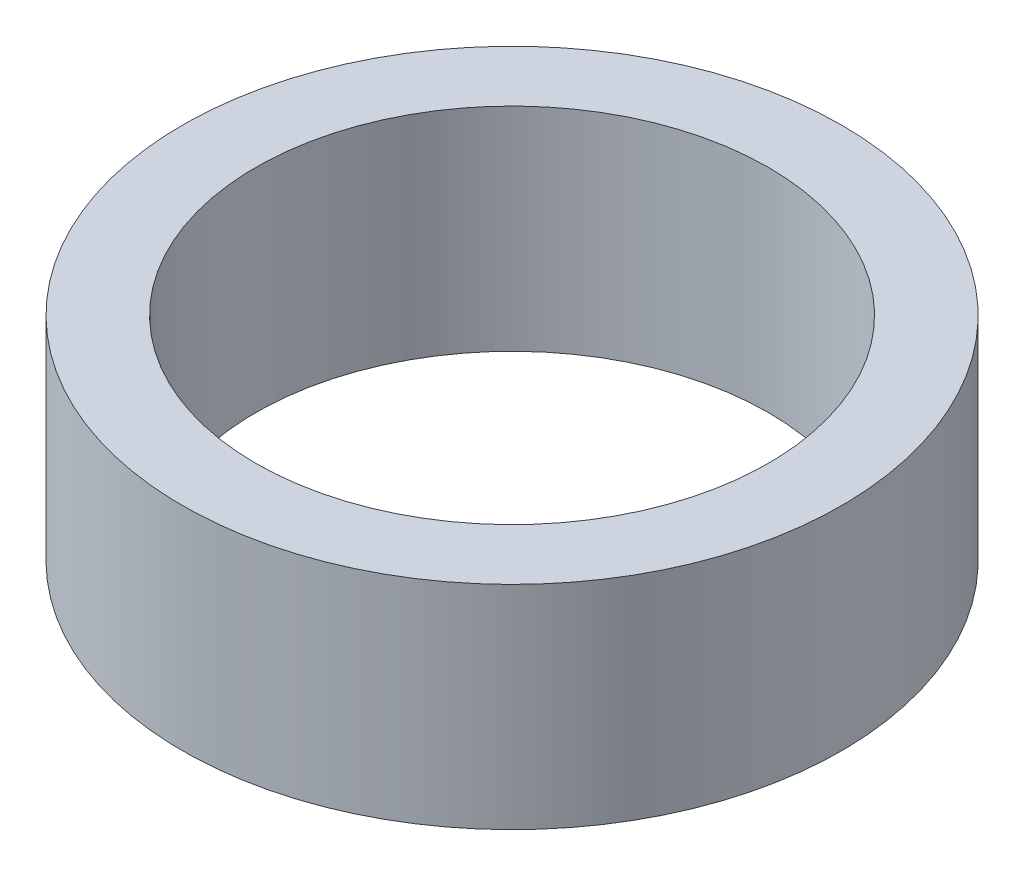
ISO-10303-21;
HEADER;
FILE_DESCRIPTION(('STEP AP214'),'2;1');
FILE_NAME('part.step','',(''),(''),'','','');
FILE_SCHEMA(('AUTOMOTIVE_DESIGN { 1 0 10303 214 1 1 1 1 }'));
ENDSEC;
DATA;
#1=APPLICATION_CONTEXT('core data for automotive mechanical design processes');
#2=APPLICATION_PROTOCOL_DEFINITION('international standard','automotive_design',2000,#1);
#3=PRODUCT_CONTEXT('',#1,'mechanical');
#4=PRODUCT('Part','Part','',(#3));
#5=PRODUCT_RELATED_PRODUCT_CATEGORY('part','',(#4));
#6=PRODUCT_DEFINITION_FORMATION('','',#4);
#7=PRODUCT_DEFINITION_CONTEXT('part definition',#1,'design');
#8=PRODUCT_DEFINITION('design','',#6,#7);
#9=PRODUCT_DEFINITION_SHAPE('','',#8);
#10=(LENGTH_UNIT() NAMED_UNIT(*) SI_UNIT(.MILLI.,.METRE.));
#11=(NAMED_UNIT(*) PLANE_ANGLE_UNIT() SI_UNIT($,.RADIAN.));
#12=(NAMED_UNIT(*) SI_UNIT($,.STERADIAN.) SOLID_ANGLE_UNIT());
#13=UNCERTAINTY_MEASURE_WITH_UNIT(LENGTH_MEASURE(1.E-05),#10,'distance_accuracy_value','');
#14=(GEOMETRIC_REPRESENTATION_CONTEXT(3) GLOBAL_UNCERTAINTY_ASSIGNED_CONTEXT((#13)) GLOBAL_UNIT_ASSIGNED_CONTEXT((#10,
#11,#12)) REPRESENTATION_CONTEXT('',''));
#15=CARTESIAN_POINT('',(0.,0.,0.));
#16=DIRECTION('',(0.,0.,1.));
#17=DIRECTION('',(1.,0.,0.));
#18=AXIS2_PLACEMENT_3D('',#15,#16,#17);
#19=CARTESIAN_POINT('',(0.,29.,0.));
#20=DIRECTION('',(0.,-1.,0.));
#21=DIRECTION('',(0.,0.,-1.));
#22=AXIS2_PLACEMENT_3D('',#19,#20,#21);
#23=CYLINDRICAL_SURFACE('',#22,45.);
#24=CARTESIAN_POINT('',(0.,29.,0.));
#25=DIRECTION('',(0.,1.,0.));
#26=DIRECTION('',(0.,0.,1.));
#27=AXIS2_PLACEMENT_3D('',#24,#25,#26);
#28=CIRCLE('',#27,45.);
#29=CARTESIAN_POINT('',(0.,29.,-45.));
#30=VERTEX_POINT('',#29);
#31=EDGE_CURVE('E10',#30,#30,#28,.T.);
#32=CARTESIAN_POINT('',(0.,0.,0.));
#33=DIRECTION('',(0.,1.,0.));
#34=DIRECTION('',(0.,0.,1.));
#35=AXIS2_PLACEMENT_3D('',#32,#33,#34);
#36=CIRCLE('',#35,45.);
#37=CARTESIAN_POINT('',(0.,0.,-45.));
#38=VERTEX_POINT('',#37);
#39=EDGE_CURVE('E37',#38,#38,#36,.T.);
#40=CARTESIAN_POINT('',(0.,29.,-45.));
#41=CARTESIAN_POINT('',(0.,28.6979166666667,-45.));
#42=CARTESIAN_POINT('',(0.,28.3958333333333,-45.));
#43=CARTESIAN_POINT('',(0.,27.7916666666667,-45.));
#44=CARTESIAN_POINT('',(0.,27.4895833333333,-45.));
#45=CARTESIAN_POINT('',(0.,26.8854166666667,-45.));
#46=CARTESIAN_POINT('',(0.,26.5833333333333,-45.));
#47=CARTESIAN_POINT('',(0.,25.9791666666667,-45.));
#48=CARTESIAN_POINT('',(0.,25.6770833333333,-45.));
#49=CARTESIAN_POINT('',(0.,25.0729166666667,-45.));
#50=CARTESIAN_POINT('',(0.,24.7708333333333,-45.));
#51=CARTESIAN_POINT('',(0.,24.1666666666667,-45.));
#52=CARTESIAN_POINT('',(0.,23.8645833333333,-45.));
#53=CARTESIAN_POINT('',(0.,23.2604166666667,-45.));
#54=CARTESIAN_POINT('',(0.,22.9583333333333,-45.));
#55=CARTESIAN_POINT('',(0.,22.3541666666667,-45.));
#56=CARTESIAN_POINT('',(0.,22.0520833333333,-45.));
#57=CARTESIAN_POINT('',(0.,21.4479166666667,-45.));
#58=CARTESIAN_POINT('',(0.,21.1458333333333,-45.));
#59=CARTESIAN_POINT('',(0.,20.5416666666667,-45.));
#60=CARTESIAN_POINT('',(0.,20.2395833333333,-45.));
#61=CARTESIAN_POINT('',(0.,19.6354166666667,-45.));
#62=CARTESIAN_POINT('',(0.,19.3333333333333,-45.));
#63=CARTESIAN_POINT('',(0.,18.7291666666667,-45.));
#64=CARTESIAN_POINT('',(0.,18.4270833333333,-45.));
#65=CARTESIAN_POINT('',(0.,17.8229166666667,-45.));
#66=CARTESIAN_POINT('',(0.,17.5208333333333,-45.));
#67=CARTESIAN_POINT('',(0.,16.9166666666667,-45.));
#68=CARTESIAN_POINT('',(0.,16.6145833333333,-45.));
#69=CARTESIAN_POINT('',(0.,16.0104166666667,-45.));
#70=CARTESIAN_POINT('',(0.,15.7083333333333,-45.));
#71=CARTESIAN_POINT('',(0.,15.1041666666667,-45.));
#72=CARTESIAN_POINT('',(0.,14.8020833333333,-45.));
#73=CARTESIAN_POINT('',(0.,14.1979166666667,-45.));
#74=CARTESIAN_POINT('',(0.,13.8958333333333,-45.));
#75=CARTESIAN_POINT('',(0.,13.2916666666667,-45.));
#76=CARTESIAN_POINT('',(0.,12.9895833333333,-45.));
#77=CARTESIAN_POINT('',(0.,12.3854166666667,-45.));
#78=CARTESIAN_POINT('',(0.,12.0833333333333,-45.));
#79=CARTESIAN_POINT('',(0.,11.4791666666667,-45.));
#80=CARTESIAN_POINT('',(0.,11.1770833333333,-45.));
#81=CARTESIAN_POINT('',(0.,10.5729166666667,-45.));
#82=CARTESIAN_POINT('',(0.,10.2708333333333,-45.));
#83=CARTESIAN_POINT('',(0.,9.66666666666667,-45.));
#84=CARTESIAN_POINT('',(0.,9.36458333333333,-45.));
#85=CARTESIAN_POINT('',(0.,8.76041666666667,-45.));
#86=CARTESIAN_POINT('',(0.,8.45833333333333,-45.));
#87=CARTESIAN_POINT('',(0.,7.85416666666667,-45.));
#88=CARTESIAN_POINT('',(0.,7.55208333333333,-45.));
#89=CARTESIAN_POINT('',(0.,6.94791666666667,-45.));
#90=CARTESIAN_POINT('',(0.,6.64583333333333,-45.));
#91=CARTESIAN_POINT('',(0.,6.04166666666667,-45.));
#92=CARTESIAN_POINT('',(0.,5.73958333333333,-45.));
#93=CARTESIAN_POINT('',(0.,5.13541666666667,-45.));
#94=CARTESIAN_POINT('',(0.,4.83333333333333,-45.));
#95=CARTESIAN_POINT('',(0.,4.22916666666667,-45.));
#96=CARTESIAN_POINT('',(0.,3.92708333333333,-45.));
#97=CARTESIAN_POINT('',(0.,3.32291666666667,-45.));
#98=CARTESIAN_POINT('',(0.,3.02083333333333,-45.));
#99=CARTESIAN_POINT('',(0.,2.41666666666667,-45.));
#100=CARTESIAN_POINT('',(0.,2.11458333333333,-45.));
#101=CARTESIAN_POINT('',(0.,1.51041666666667,-45.));
#102=CARTESIAN_POINT('',(0.,1.20833333333333,-45.));
#103=CARTESIAN_POINT('',(0.,0.604166666666667,-45.));
#104=CARTESIAN_POINT('',(0.,0.302083333333333,-45.));
#105=CARTESIAN_POINT('',(0.,0.,-45.));
#106=B_SPLINE_CURVE_WITH_KNOTS('',3,(#40,#41,#42,#43,#44,#45,#46,#47,#48,#49,#50,#51,#52,#53,
#54,#55,#56,#57,#58,#59,#60,#61,#62,#63,#64,#65,#66,#67,#68,#69,#70,#71,#72,#73,#74,#75,#76,#77,
#78,#79,#80,#81,#82,#83,#84,#85,#86,#87,#88,#89,#90,#91,#92,#93,#94,#95,#96,#97,#98,#99,#100,
#101,#102,#103,#104,#105),.UNSPECIFIED.,.F.,.F.,(4,2,2,2,2,2,2,2,2,2,2,2,2,2,2,2,2,2,2,2,2,2,2,
2,2,2,2,2,2,2,2,2,4),(0.,0.906249999999997,1.8125,2.71875,3.625,4.53125,5.4375,6.34375,7.25,
8.15625,9.0625,9.96875,10.875,11.78125,12.6875,13.59375,14.5,15.40625,16.3125,17.21875,18.125,
19.03125,19.9375,20.84375,21.75,22.65625,23.5625,24.46875,25.375,26.28125,27.1875,28.09375,29.),.UNSPECIFIED.);
#107=EDGE_CURVE('BSEAM40',#30,#38,#106,.T.);
#108=ORIENTED_EDGE('',*,*,#31,.F.);
#109=ORIENTED_EDGE('',*,*,#39,.T.);
#110=ORIENTED_EDGE('',*,*,#107,.T.);
#111=ORIENTED_EDGE('',*,*,#107,.F.);
#112=EDGE_LOOP('',(#108,#110,#109,#111));
#113=FACE_BOUND('',#112,.T.);
#114=ADVANCED_FACE('F40',(#113),#23,.T.);
#115=CARTESIAN_POINT('',(0.,29.,0.));
#116=DIRECTION('',(0.,1.,0.));
#117=DIRECTION('',(0.,0.,1.));
#118=AXIS2_PLACEMENT_3D('',#115,#116,#117);
#119=PLANE('',#118);
#120=CARTESIAN_POINT('',(0.,29.,0.));
#121=DIRECTION('',(0.,1.,0.));
#122=DIRECTION('',(0.,0.,1.));
#123=AXIS2_PLACEMENT_3D('',#120,#121,#122);
#124=CIRCLE('',#123,35.);
#125=CARTESIAN_POINT('',(0.,29.,-35.));
#126=VERTEX_POINT('',#125);
#127=EDGE_CURVE('E50',#126,#126,#124,.T.);
#128=ORIENTED_EDGE('',*,*,#127,.F.);
#129=EDGE_LOOP('',(#128));
#130=FACE_BOUND('',#129,.T.);
#131=ORIENTED_EDGE('',*,*,#31,.T.);
#132=EDGE_LOOP('',(#131));
#133=FACE_BOUND('',#132,.T.);
#134=ADVANCED_FACE('F59',(#130,#133),#119,.T.);
#135=CARTESIAN_POINT('',(0.,0.,0.));
#136=DIRECTION('',(0.,1.,0.));
#137=DIRECTION('',(0.,0.,1.));
#138=AXIS2_PLACEMENT_3D('',#135,#136,#137);
#139=PLANE('',#138);
#140=CARTESIAN_POINT('',(0.,0.,0.));
#141=DIRECTION('',(0.,1.,0.));
#142=DIRECTION('',(0.,0.,1.));
#143=AXIS2_PLACEMENT_3D('',#140,#141,#142);
#144=CIRCLE('',#143,35.);
#145=CARTESIAN_POINT('',(0.,0.,-35.));
#146=VERTEX_POINT('',#145);
#147=EDGE_CURVE('E47',#146,#146,#144,.T.);
#148=ORIENTED_EDGE('',*,*,#147,.T.);
#149=EDGE_LOOP('',(#148));
#150=FACE_BOUND('',#149,.T.);
#151=ORIENTED_EDGE('',*,*,#39,.F.);
#152=EDGE_LOOP('',(#151));
#153=FACE_BOUND('',#152,.T.);
#154=ADVANCED_FACE('F58',(#150,#153),#139,.F.);
#155=CARTESIAN_POINT('',(0.,29.,0.));
#156=DIRECTION('',(0.,-1.,0.));
#157=DIRECTION('',(0.,0.,-1.));
#158=AXIS2_PLACEMENT_3D('',#155,#156,#157);
#159=CYLINDRICAL_SURFACE('',#158,35.);
#160=CARTESIAN_POINT('',(0.,29.,-35.));
#161=CARTESIAN_POINT('',(0.,28.6979166666667,-35.));
#162=CARTESIAN_POINT('',(0.,28.3958333333333,-35.));
#163=CARTESIAN_POINT('',(0.,27.7916666666667,-35.));
#164=CARTESIAN_POINT('',(0.,27.4895833333333,-35.));
#165=CARTESIAN_POINT('',(0.,26.8854166666667,-35.));
#166=CARTESIAN_POINT('',(0.,26.5833333333333,-35.));
#167=CARTESIAN_POINT('',(0.,25.9791666666667,-35.));
#168=CARTESIAN_POINT('',(0.,25.6770833333333,-35.));
#169=CARTESIAN_POINT('',(0.,25.0729166666667,-35.));
#170=CARTESIAN_POINT('',(0.,24.7708333333333,-35.));
#171=CARTESIAN_POINT('',(0.,24.1666666666667,-35.));
#172=CARTESIAN_POINT('',(0.,23.8645833333333,-35.));
#173=CARTESIAN_POINT('',(0.,23.2604166666667,-35.));
#174=CARTESIAN_POINT('',(0.,22.9583333333333,-35.));
#175=CARTESIAN_POINT('',(0.,22.3541666666667,-35.));
#176=CARTESIAN_POINT('',(0.,22.0520833333333,-35.));
#177=CARTESIAN_POINT('',(0.,21.4479166666667,-35.));
#178=CARTESIAN_POINT('',(0.,21.1458333333333,-35.));
#179=CARTESIAN_POINT('',(0.,20.5416666666667,-35.));
#180=CARTESIAN_POINT('',(0.,20.2395833333333,-35.));
#181=CARTESIAN_POINT('',(0.,19.6354166666667,-35.));
#182=CARTESIAN_POINT('',(0.,19.3333333333333,-35.));
#183=CARTESIAN_POINT('',(0.,18.7291666666667,-35.));
#184=CARTESIAN_POINT('',(0.,18.4270833333333,-35.));
#185=CARTESIAN_POINT('',(0.,17.8229166666667,-35.));
#186=CARTESIAN_POINT('',(0.,17.5208333333333,-35.));
#187=CARTESIAN_POINT('',(0.,16.9166666666667,-35.));
#188=CARTESIAN_POINT('',(0.,16.6145833333333,-35.));
#189=CARTESIAN_POINT('',(0.,16.0104166666667,-35.));
#190=CARTESIAN_POINT('',(0.,15.7083333333333,-35.));
#191=CARTESIAN_POINT('',(0.,15.1041666666667,-35.));
#192=CARTESIAN_POINT('',(0.,14.8020833333333,-35.));
#193=CARTESIAN_POINT('',(0.,14.1979166666667,-35.));
#194=CARTESIAN_POINT('',(0.,13.8958333333333,-35.));
#195=CARTESIAN_POINT('',(0.,13.2916666666667,-35.));
#196=CARTESIAN_POINT('',(0.,12.9895833333333,-35.));
#197=CARTESIAN_POINT('',(0.,12.3854166666667,-35.));
#198=CARTESIAN_POINT('',(0.,12.0833333333333,-35.));
#199=CARTESIAN_POINT('',(0.,11.4791666666667,-35.));
#200=CARTESIAN_POINT('',(0.,11.1770833333333,-35.));
#201=CARTESIAN_POINT('',(0.,10.5729166666667,-35.));
#202=CARTESIAN_POINT('',(0.,10.2708333333333,-35.));
#203=CARTESIAN_POINT('',(0.,9.66666666666667,-35.));
#204=CARTESIAN_POINT('',(0.,9.36458333333333,-35.));
#205=CARTESIAN_POINT('',(0.,8.76041666666667,-35.));
#206=CARTESIAN_POINT('',(0.,8.45833333333333,-35.));
#207=CARTESIAN_POINT('',(0.,7.85416666666667,-35.));
#208=CARTESIAN_POINT('',(0.,7.55208333333333,-35.));
#209=CARTESIAN_POINT('',(0.,6.94791666666667,-35.));
#210=CARTESIAN_POINT('',(0.,6.64583333333333,-35.));
#211=CARTESIAN_POINT('',(0.,6.04166666666667,-35.));
#212=CARTESIAN_POINT('',(0.,5.73958333333333,-35.));
#213=CARTESIAN_POINT('',(0.,5.13541666666667,-35.));
#214=CARTESIAN_POINT('',(0.,4.83333333333333,-35.));
#215=CARTESIAN_POINT('',(0.,4.22916666666667,-35.));
#216=CARTESIAN_POINT('',(0.,3.92708333333333,-35.));
#217=CARTESIAN_POINT('',(0.,3.32291666666667,-35.));
#218=CARTESIAN_POINT('',(0.,3.02083333333333,-35.));
#219=CARTESIAN_POINT('',(0.,2.41666666666667,-35.));
#220=CARTESIAN_POINT('',(0.,2.11458333333333,-35.));
#221=CARTESIAN_POINT('',(0.,1.51041666666667,-35.));
#222=CARTESIAN_POINT('',(0.,1.20833333333333,-35.));
#223=CARTESIAN_POINT('',(0.,0.604166666666667,-35.));
#224=CARTESIAN_POINT('',(0.,0.302083333333333,-35.));
#225=CARTESIAN_POINT('',(0.,0.,-35.));
#226=B_SPLINE_CURVE_WITH_KNOTS('',3,(#160,#161,#162,#163,#164,#165,#166,#167,#168,#169,#170,
#171,#172,#173,#174,#175,#176,#177,#178,#179,#180,#181,#182,#183,#184,#185,#186,#187,#188,#189,
#190,#191,#192,#193,#194,#195,#196,#197,#198,#199,#200,#201,#202,#203,#204,#205,#206,#207,#208,
#209,#210,#211,#212,#213,#214,#215,#216,#217,#218,#219,#220,#221,#222,#223,#224,#225),
.UNSPECIFIED.,.F.,.F.,(4,2,2,2,2,2,2,2,2,2,2,2,2,2,2,2,2,2,2,2,2,2,2,2,2,2,2,2,2,2,2,2,4),(0.,
0.906250000000001,1.8125,2.71875,3.625,4.53125,5.4375,6.34375,7.25,8.15625,9.0625,9.96875,
10.875,11.78125,12.6875,13.59375,14.5,15.40625,16.3125,17.21875,18.125,19.03125,19.9375,
20.84375,21.75,22.65625,23.5625,24.46875,25.375,26.28125,27.1875,28.09375,29.),.UNSPECIFIED.);
#227=EDGE_CURVE('BSEAM54',#126,#146,#226,.T.);
#228=ORIENTED_EDGE('',*,*,#127,.T.);
#229=ORIENTED_EDGE('',*,*,#147,.F.);
#230=ORIENTED_EDGE('',*,*,#227,.T.);
#231=ORIENTED_EDGE('',*,*,#227,.F.);
#232=EDGE_LOOP('',(#228,#230,#229,#231));
#233=FACE_BOUND('',#232,.T.);
#234=ADVANCED_FACE('F54',(#233),#159,.F.);
#235=CLOSED_SHELL('',(#114,#134,#154,#234));
#236=MANIFOLD_SOLID_BREP('B2',#235);
#237=ADVANCED_BREP_SHAPE_REPRESENTATION('',(#18,#236),#14);
#238=SHAPE_DEFINITION_REPRESENTATION(#9,#237);
ENDSEC;
END-ISO-10303-21;
